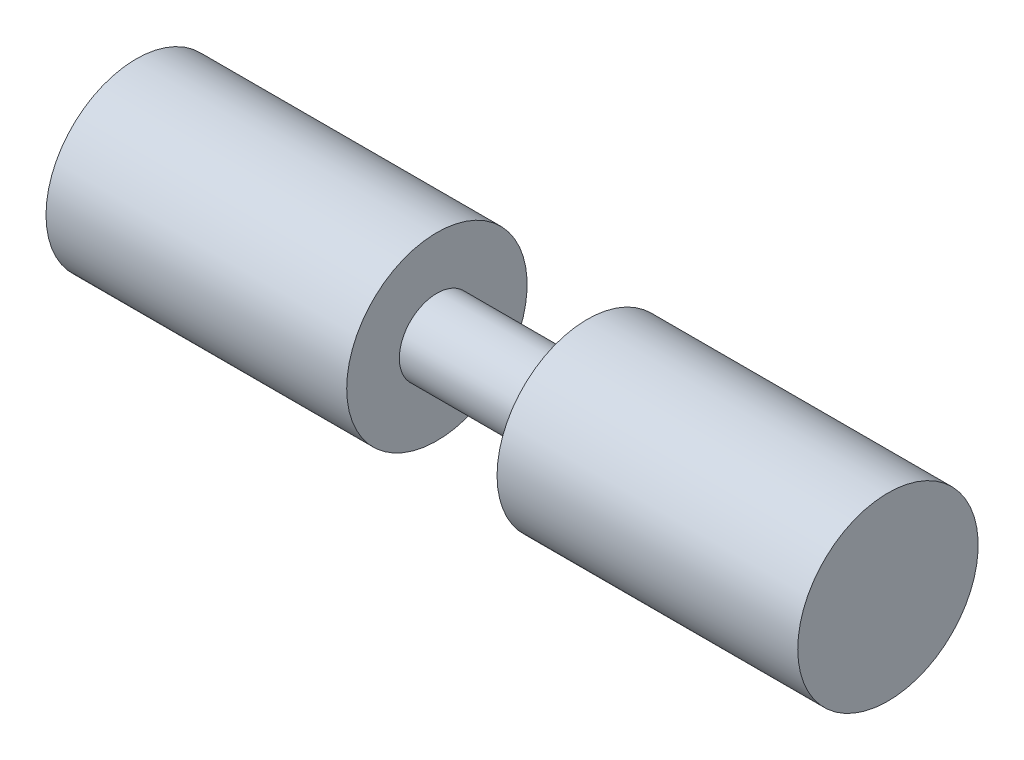
ISO-10303-21;
HEADER;
FILE_DESCRIPTION(('STEP AP214'),'2;1');
FILE_NAME('part.step','',(''),(''),'','','');
FILE_SCHEMA(('AUTOMOTIVE_DESIGN { 1 0 10303 214 1 1 1 1 }'));
ENDSEC;
DATA;
#1=APPLICATION_CONTEXT('core data for automotive mechanical design processes');
#2=APPLICATION_PROTOCOL_DEFINITION('international standard','automotive_design',2000,#1);
#3=PRODUCT_CONTEXT('',#1,'mechanical');
#4=PRODUCT('Part','Part','',(#3));
#5=PRODUCT_RELATED_PRODUCT_CATEGORY('part','',(#4));
#6=PRODUCT_DEFINITION_FORMATION('','',#4);
#7=PRODUCT_DEFINITION_CONTEXT('part definition',#1,'design');
#8=PRODUCT_DEFINITION('design','',#6,#7);
#9=PRODUCT_DEFINITION_SHAPE('','',#8);
#10=(LENGTH_UNIT() NAMED_UNIT(*) SI_UNIT(.MILLI.,.METRE.));
#11=(NAMED_UNIT(*) PLANE_ANGLE_UNIT() SI_UNIT($,.RADIAN.));
#12=(NAMED_UNIT(*) SI_UNIT($,.STERADIAN.) SOLID_ANGLE_UNIT());
#13=UNCERTAINTY_MEASURE_WITH_UNIT(LENGTH_MEASURE(1.E-05),#10,'distance_accuracy_value','');
#14=(GEOMETRIC_REPRESENTATION_CONTEXT(3) GLOBAL_UNCERTAINTY_ASSIGNED_CONTEXT((#13)) GLOBAL_UNIT_ASSIGNED_CONTEXT((#10,
#11,#12)) REPRESENTATION_CONTEXT('',''));
#15=CARTESIAN_POINT('',(0.,0.,0.));
#16=DIRECTION('',(0.,0.,1.));
#17=DIRECTION('',(1.,0.,0.));
#18=AXIS2_PLACEMENT_3D('',#15,#16,#17);
#19=CARTESIAN_POINT('',(0.,0.,0.));
#20=DIRECTION('',(1.,0.,0.));
#21=DIRECTION('',(0.,0.,-1.));
#22=AXIS2_PLACEMENT_3D('',#19,#20,#21);
#23=PLANE('',#22);
#24=CARTESIAN_POINT('',(0.,0.,0.));
#25=DIRECTION('',(-1.,0.,0.));
#26=DIRECTION('',(0.,0.,1.));
#27=AXIS2_PLACEMENT_3D('',#24,#25,#26);
#28=CIRCLE('',#27,15.24);
#29=CARTESIAN_POINT('',(0.,0.,15.24));
#30=VERTEX_POINT('',#29);
#31=EDGE_CURVE('E10',#30,#30,#28,.T.);
#32=ORIENTED_EDGE('',*,*,#31,.T.);
#33=EDGE_LOOP('',(#32));
#34=FACE_BOUND('',#33,.T.);
#35=ADVANCED_FACE('F31',(#34),#23,.F.);
#36=CARTESIAN_POINT('',(0.,0.,0.));
#37=DIRECTION('',(-1.,0.,0.));
#38=DIRECTION('',(0.,0.,1.));
#39=AXIS2_PLACEMENT_3D('',#36,#37,#38);
#40=CYLINDRICAL_SURFACE('',#39,15.24);
#41=ORIENTED_EDGE('',*,*,#31,.F.);
#42=EDGE_LOOP('',(#41));
#43=FACE_BOUND('',#42,.T.);
#44=CARTESIAN_POINT('',(50.8,0.,0.));
#45=DIRECTION('',(-1.,0.,0.));
#46=DIRECTION('',(0.,0.,1.));
#47=AXIS2_PLACEMENT_3D('',#44,#45,#46);
#48=CIRCLE('',#47,15.24);
#49=CARTESIAN_POINT('',(50.8,0.,15.24));
#50=VERTEX_POINT('',#49);
#51=EDGE_CURVE('E37',#50,#50,#48,.T.);
#52=ORIENTED_EDGE('',*,*,#51,.T.);
#53=EDGE_LOOP('',(#52));
#54=FACE_BOUND('',#53,.T.);
#55=ADVANCED_FACE('F69',(#43,#54),#40,.T.);
#56=CARTESIAN_POINT('',(50.8,15.24,0.));
#57=DIRECTION('',(-1.,0.,0.));
#58=DIRECTION('',(0.,0.,1.));
#59=AXIS2_PLACEMENT_3D('',#56,#57,#58);
#60=PLANE('',#59);
#61=ORIENTED_EDGE('',*,*,#51,.F.);
#62=EDGE_LOOP('',(#61));
#63=FACE_BOUND('',#62,.T.);
#64=CARTESIAN_POINT('',(50.8,0.,0.));
#65=DIRECTION('',(-1.,0.,0.));
#66=DIRECTION('',(0.,0.,1.));
#67=AXIS2_PLACEMENT_3D('',#64,#65,#66);
#68=CIRCLE('',#67,6.35);
#69=CARTESIAN_POINT('',(50.8,0.,6.35));
#70=VERTEX_POINT('',#69);
#71=EDGE_CURVE('E41',#70,#70,#68,.T.);
#72=ORIENTED_EDGE('',*,*,#71,.T.);
#73=EDGE_LOOP('',(#72));
#74=FACE_BOUND('',#73,.T.);
#75=ADVANCED_FACE('F73',(#63,#74),#60,.F.);
#76=CARTESIAN_POINT('',(0.,0.,0.));
#77=DIRECTION('',(-1.,0.,0.));
#78=DIRECTION('',(0.,0.,1.));
#79=AXIS2_PLACEMENT_3D('',#76,#77,#78);
#80=CYLINDRICAL_SURFACE('',#79,6.35);
#81=ORIENTED_EDGE('',*,*,#71,.F.);
#82=EDGE_LOOP('',(#81));
#83=FACE_BOUND('',#82,.T.);
#84=CARTESIAN_POINT('',(76.2,0.,0.));
#85=DIRECTION('',(-1.,0.,0.));
#86=DIRECTION('',(0.,0.,1.));
#87=AXIS2_PLACEMENT_3D('',#84,#85,#86);
#88=CIRCLE('',#87,6.35);
#89=CARTESIAN_POINT('',(76.2,0.,6.35));
#90=VERTEX_POINT('',#89);
#91=EDGE_CURVE('E45',#90,#90,#88,.T.);
#92=ORIENTED_EDGE('',*,*,#91,.T.);
#93=EDGE_LOOP('',(#92));
#94=FACE_BOUND('',#93,.T.);
#95=ADVANCED_FACE('F78',(#83,#94),#80,.T.);
#96=CARTESIAN_POINT('',(76.2,6.35,0.));
#97=DIRECTION('',(1.,0.,0.));
#98=DIRECTION('',(0.,0.,-1.));
#99=AXIS2_PLACEMENT_3D('',#96,#97,#98);
#100=PLANE('',#99);
#101=ORIENTED_EDGE('',*,*,#91,.F.);
#102=EDGE_LOOP('',(#101));
#103=FACE_BOUND('',#102,.T.);
#104=CARTESIAN_POINT('',(76.2,0.,0.));
#105=DIRECTION('',(-1.,0.,0.));
#106=DIRECTION('',(0.,0.,1.));
#107=AXIS2_PLACEMENT_3D('',#104,#105,#106);
#108=CIRCLE('',#107,15.24);
#109=CARTESIAN_POINT('',(76.2,0.,15.24));
#110=VERTEX_POINT('',#109);
#111=EDGE_CURVE('E50',#110,#110,#108,.T.);
#112=ORIENTED_EDGE('',*,*,#111,.T.);
#113=EDGE_LOOP('',(#112));
#114=FACE_BOUND('',#113,.T.);
#115=ADVANCED_FACE('F65',(#103,#114),#100,.F.);
#116=CARTESIAN_POINT('',(0.,0.,0.));
#117=DIRECTION('',(-1.,0.,0.));
#118=DIRECTION('',(0.,0.,1.));
#119=AXIS2_PLACEMENT_3D('',#116,#117,#118);
#120=CYLINDRICAL_SURFACE('',#119,15.24);
#121=ORIENTED_EDGE('',*,*,#111,.F.);
#122=EDGE_LOOP('',(#121));
#123=FACE_BOUND('',#122,.T.);
#124=CARTESIAN_POINT('',(127.,0.,0.));
#125=DIRECTION('',(-1.,0.,0.));
#126=DIRECTION('',(0.,0.,1.));
#127=AXIS2_PLACEMENT_3D('',#124,#125,#126);
#128=CIRCLE('',#127,15.24);
#129=CARTESIAN_POINT('',(127.,0.,15.24));
#130=VERTEX_POINT('',#129);
#131=EDGE_CURVE('E53',#130,#130,#128,.T.);
#132=ORIENTED_EDGE('',*,*,#131,.T.);
#133=EDGE_LOOP('',(#132));
#134=FACE_BOUND('',#133,.T.);
#135=ADVANCED_FACE('F57',(#123,#134),#120,.T.);
#136=CARTESIAN_POINT('',(127.,15.24,0.));
#137=DIRECTION('',(-1.,0.,0.));
#138=DIRECTION('',(0.,0.,1.));
#139=AXIS2_PLACEMENT_3D('',#136,#137,#138);
#140=PLANE('',#139);
#141=ORIENTED_EDGE('',*,*,#131,.F.);
#142=EDGE_LOOP('',(#141));
#143=FACE_BOUND('',#142,.T.);
#144=ADVANCED_FACE('F59',(#143),#140,.F.);
#145=CLOSED_SHELL('',(#35,#55,#75,#95,#115,#135,#144));
#146=MANIFOLD_SOLID_BREP('B2',#145);
#147=ADVANCED_BREP_SHAPE_REPRESENTATION('',(#18,#146),#14);
#148=SHAPE_DEFINITION_REPRESENTATION(#9,#147);
ENDSEC;
END-ISO-10303-21;
